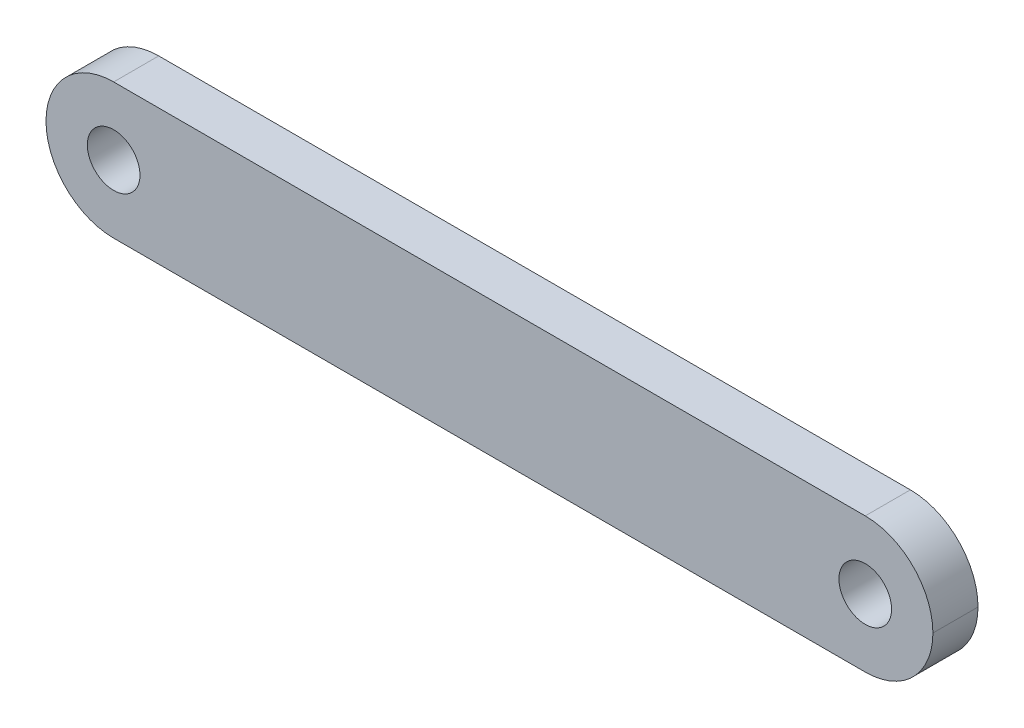
ISO-10303-21;
HEADER;
FILE_DESCRIPTION(('STEP AP214'),'2;1');
FILE_NAME('part.step','',(''),(''),'','','');
FILE_SCHEMA(('AUTOMOTIVE_DESIGN { 1 0 10303 214 1 1 1 1 }'));
ENDSEC;
DATA;
#1=APPLICATION_CONTEXT('core data for automotive mechanical design processes');
#2=APPLICATION_PROTOCOL_DEFINITION('international standard','automotive_design',2000,#1);
#3=PRODUCT_CONTEXT('',#1,'mechanical');
#4=PRODUCT('Part','Part','',(#3));
#5=PRODUCT_RELATED_PRODUCT_CATEGORY('part','',(#4));
#6=PRODUCT_DEFINITION_FORMATION('','',#4);
#7=PRODUCT_DEFINITION_CONTEXT('part definition',#1,'design');
#8=PRODUCT_DEFINITION('design','',#6,#7);
#9=PRODUCT_DEFINITION_SHAPE('','',#8);
#10=(LENGTH_UNIT() NAMED_UNIT(*) SI_UNIT(.MILLI.,.METRE.));
#11=(NAMED_UNIT(*) PLANE_ANGLE_UNIT() SI_UNIT($,.RADIAN.));
#12=(NAMED_UNIT(*) SI_UNIT($,.STERADIAN.) SOLID_ANGLE_UNIT());
#13=UNCERTAINTY_MEASURE_WITH_UNIT(LENGTH_MEASURE(1.E-05),#10,'distance_accuracy_value','');
#14=(GEOMETRIC_REPRESENTATION_CONTEXT(3) GLOBAL_UNCERTAINTY_ASSIGNED_CONTEXT((#13)) GLOBAL_UNIT_ASSIGNED_CONTEXT((#10,
#11,#12)) REPRESENTATION_CONTEXT('',''));
#15=CARTESIAN_POINT('',(0.,0.,0.));
#16=DIRECTION('',(0.,0.,1.));
#17=DIRECTION('',(1.,0.,0.));
#18=AXIS2_PLACEMENT_3D('',#15,#16,#17);
#19=CARTESIAN_POINT('',(0.,0.,6.));
#20=DIRECTION('',(0.,0.,-1.));
#21=DIRECTION('',(-1.,0.,0.));
#22=AXIS2_PLACEMENT_3D('',#19,#20,#21);
#23=PLANE('',#22);
#24=CARTESIAN_POINT('',(109.,9.,6.));
#25=DIRECTION('',(0.,0.,-1.));
#26=DIRECTION('',(-1.,0.,0.));
#27=AXIS2_PLACEMENT_3D('',#24,#25,#26);
#28=CIRCLE('',#27,9.);
#29=CARTESIAN_POINT('',(109.,0.,6.));
#30=VERTEX_POINT('',#29);
#31=CARTESIAN_POINT('',(118.,9.,6.));
#32=VERTEX_POINT('',#31);
#33=EDGE_CURVE('E49',#30,#32,#28,.F.);
#34=ORIENTED_EDGE('',*,*,#33,.T.);
#35=CARTESIAN_POINT('',(109.,9.,6.));
#36=DIRECTION('',(0.,0.,-1.));
#37=DIRECTION('',(-1.,0.,0.));
#38=AXIS2_PLACEMENT_3D('',#35,#36,#37);
#39=CIRCLE('',#38,9.);
#40=CARTESIAN_POINT('',(109.,18.,6.));
#41=VERTEX_POINT('',#40);
#42=EDGE_CURVE('E130',#32,#41,#39,.F.);
#43=ORIENTED_EDGE('',*,*,#42,.T.);
#44=DIRECTION('',(-1.,0.,0.));
#45=VECTOR('',#44,1.);
#46=CARTESIAN_POINT('',(0.,18.,6.));
#47=LINE('',#46,#45);
#48=CARTESIAN_POINT('',(9.,18.,6.));
#49=VERTEX_POINT('',#48);
#50=EDGE_CURVE('E106',#41,#49,#47,.T.);
#51=ORIENTED_EDGE('',*,*,#50,.T.);
#52=CARTESIAN_POINT('',(9.,9.,6.));
#53=DIRECTION('',(0.,0.,-1.));
#54=DIRECTION('',(-1.,0.,0.));
#55=AXIS2_PLACEMENT_3D('',#52,#53,#54);
#56=CIRCLE('',#55,9.);
#57=CARTESIAN_POINT('',(0.,9.,6.));
#58=VERTEX_POINT('',#57);
#59=EDGE_CURVE('E96',#49,#58,#56,.F.);
#60=ORIENTED_EDGE('',*,*,#59,.T.);
#61=CARTESIAN_POINT('',(9.,9.,6.));
#62=DIRECTION('',(0.,0.,-1.));
#63=DIRECTION('',(-1.,0.,0.));
#64=AXIS2_PLACEMENT_3D('',#61,#62,#63);
#65=CIRCLE('',#64,9.);
#66=CARTESIAN_POINT('',(9.,0.,6.));
#67=VERTEX_POINT('',#66);
#68=EDGE_CURVE('E127',#58,#67,#65,.F.);
#69=ORIENTED_EDGE('',*,*,#68,.T.);
#70=DIRECTION('',(1.,0.,0.));
#71=VECTOR('',#70,1.);
#72=CARTESIAN_POINT('',(0.,0.,6.));
#73=LINE('',#72,#71);
#74=EDGE_CURVE('E113',#67,#30,#73,.T.);
#75=ORIENTED_EDGE('',*,*,#74,.T.);
#76=EDGE_LOOP('',(#34,#43,#51,#60,#69,#75));
#77=FACE_BOUND('',#76,.T.);
#78=CARTESIAN_POINT('',(9.,9.,6.));
#79=DIRECTION('',(0.,0.,1.));
#80=DIRECTION('',(1.,0.,0.));
#81=AXIS2_PLACEMENT_3D('',#78,#79,#80);
#82=CIRCLE('',#81,3.5);
#83=CARTESIAN_POINT('',(12.5,9.,6.));
#84=VERTEX_POINT('',#83);
#85=EDGE_CURVE('E117',#84,#84,#82,.T.);
#86=ORIENTED_EDGE('',*,*,#85,.F.);
#87=EDGE_LOOP('',(#86));
#88=FACE_BOUND('',#87,.T.);
#89=CARTESIAN_POINT('',(109.,9.,6.));
#90=DIRECTION('',(0.,0.,1.));
#91=DIRECTION('',(-1.,0.,0.));
#92=AXIS2_PLACEMENT_3D('',#89,#90,#91);
#93=CIRCLE('',#92,3.50000000000001);
#94=CARTESIAN_POINT('',(105.5,9.,6.));
#95=VERTEX_POINT('',#94);
#96=EDGE_CURVE('E135',#95,#95,#93,.T.);
#97=ORIENTED_EDGE('',*,*,#96,.F.);
#98=EDGE_LOOP('',(#97));
#99=FACE_BOUND('',#98,.T.);
#100=ADVANCED_FACE('F32',(#77,#88,#99),#23,.F.);
#101=CARTESIAN_POINT('',(0.,0.,0.));
#102=DIRECTION('',(0.,0.,-1.));
#103=DIRECTION('',(-1.,0.,0.));
#104=AXIS2_PLACEMENT_3D('',#101,#102,#103);
#105=PLANE('',#104);
#106=CARTESIAN_POINT('',(9.,9.,0.));
#107=DIRECTION('',(0.,0.,1.));
#108=DIRECTION('',(1.,0.,0.));
#109=AXIS2_PLACEMENT_3D('',#106,#107,#108);
#110=CIRCLE('',#109,3.5);
#111=CARTESIAN_POINT('',(12.5,9.,0.));
#112=VERTEX_POINT('',#111);
#113=EDGE_CURVE('E147',#112,#112,#110,.T.);
#114=ORIENTED_EDGE('',*,*,#113,.T.);
#115=EDGE_LOOP('',(#114));
#116=FACE_BOUND('',#115,.T.);
#117=DIRECTION('',(-1.,0.,0.));
#118=VECTOR('',#117,1.);
#119=CARTESIAN_POINT('',(0.,18.,0.));
#120=LINE('',#119,#118);
#121=CARTESIAN_POINT('',(109.,18.,0.));
#122=VERTEX_POINT('',#121);
#123=CARTESIAN_POINT('',(9.,18.,0.));
#124=VERTEX_POINT('',#123);
#125=EDGE_CURVE('E103',#122,#124,#120,.T.);
#126=ORIENTED_EDGE('',*,*,#125,.F.);
#127=CARTESIAN_POINT('',(109.,9.,0.));
#128=DIRECTION('',(0.,0.,-1.));
#129=DIRECTION('',(-1.,0.,0.));
#130=AXIS2_PLACEMENT_3D('',#127,#128,#129);
#131=CIRCLE('',#130,9.);
#132=CARTESIAN_POINT('',(118.,9.,0.));
#133=VERTEX_POINT('',#132);
#134=EDGE_CURVE('E87',#122,#133,#131,.T.);
#135=ORIENTED_EDGE('',*,*,#134,.T.);
#136=CARTESIAN_POINT('',(109.,9.,0.));
#137=DIRECTION('',(0.,0.,-1.));
#138=DIRECTION('',(-1.,0.,0.));
#139=AXIS2_PLACEMENT_3D('',#136,#137,#138);
#140=CIRCLE('',#139,9.);
#141=CARTESIAN_POINT('',(109.,0.,0.));
#142=VERTEX_POINT('',#141);
#143=EDGE_CURVE('E97',#133,#142,#140,.T.);
#144=ORIENTED_EDGE('',*,*,#143,.T.);
#145=DIRECTION('',(1.,0.,0.));
#146=VECTOR('',#145,1.);
#147=CARTESIAN_POINT('',(0.,0.,0.));
#148=LINE('',#147,#146);
#149=CARTESIAN_POINT('',(9.,0.,0.));
#150=VERTEX_POINT('',#149);
#151=EDGE_CURVE('E114',#150,#142,#148,.T.);
#152=ORIENTED_EDGE('',*,*,#151,.F.);
#153=CARTESIAN_POINT('',(9.,9.,0.));
#154=DIRECTION('',(0.,0.,-1.));
#155=DIRECTION('',(-1.,0.,0.));
#156=AXIS2_PLACEMENT_3D('',#153,#154,#155);
#157=CIRCLE('',#156,9.);
#158=CARTESIAN_POINT('',(0.,9.,0.));
#159=VERTEX_POINT('',#158);
#160=EDGE_CURVE('E123',#150,#159,#157,.T.);
#161=ORIENTED_EDGE('',*,*,#160,.T.);
#162=CARTESIAN_POINT('',(9.,9.,0.));
#163=DIRECTION('',(0.,0.,-1.));
#164=DIRECTION('',(-1.,0.,0.));
#165=AXIS2_PLACEMENT_3D('',#162,#163,#164);
#166=CIRCLE('',#165,9.);
#167=EDGE_CURVE('E107',#159,#124,#166,.T.);
#168=ORIENTED_EDGE('',*,*,#167,.T.);
#169=EDGE_LOOP('',(#126,#135,#144,#152,#161,#168));
#170=FACE_BOUND('',#169,.T.);
#171=CARTESIAN_POINT('',(109.,9.,0.));
#172=DIRECTION('',(0.,0.,1.));
#173=DIRECTION('',(-1.,0.,0.));
#174=AXIS2_PLACEMENT_3D('',#171,#172,#173);
#175=CIRCLE('',#174,3.50000000000001);
#176=CARTESIAN_POINT('',(105.5,9.,0.));
#177=VERTEX_POINT('',#176);
#178=EDGE_CURVE('E133',#177,#177,#175,.T.);
#179=ORIENTED_EDGE('',*,*,#178,.T.);
#180=EDGE_LOOP('',(#179));
#181=FACE_BOUND('',#180,.T.);
#182=ADVANCED_FACE('F110',(#116,#170,#181),#105,.T.);
#183=CARTESIAN_POINT('',(0.,0.,6.));
#184=DIRECTION('',(0.,1.,0.));
#185=DIRECTION('',(0.,0.,1.));
#186=AXIS2_PLACEMENT_3D('',#183,#184,#185);
#187=PLANE('',#186);
#188=ORIENTED_EDGE('',*,*,#151,.T.);
#189=DIRECTION('',(0.,0.,-1.));
#190=VECTOR('',#189,1.);
#191=CARTESIAN_POINT('',(109.,0.,6.));
#192=LINE('',#191,#190);
#193=EDGE_CURVE('E11',#142,#30,#192,.F.);
#194=ORIENTED_EDGE('',*,*,#193,.T.);
#195=ORIENTED_EDGE('',*,*,#74,.F.);
#196=DIRECTION('',(0.,0.,-1.));
#197=VECTOR('',#196,1.);
#198=CARTESIAN_POINT('',(9.,0.,6.));
#199=LINE('',#198,#197);
#200=EDGE_CURVE('E41',#67,#150,#199,.T.);
#201=ORIENTED_EDGE('',*,*,#200,.T.);
#202=EDGE_LOOP('',(#188,#194,#195,#201));
#203=FACE_BOUND('',#202,.T.);
#204=ADVANCED_FACE('F163',(#203),#187,.F.);
#205=CARTESIAN_POINT('',(0.,18.,6.));
#206=DIRECTION('',(0.,-1.,0.));
#207=DIRECTION('',(0.,0.,-1.));
#208=AXIS2_PLACEMENT_3D('',#205,#206,#207);
#209=PLANE('',#208);
#210=ORIENTED_EDGE('',*,*,#50,.F.);
#211=DIRECTION('',(0.,0.,-1.));
#212=VECTOR('',#211,1.);
#213=CARTESIAN_POINT('',(109.,18.,6.));
#214=LINE('',#213,#212);
#215=EDGE_CURVE('E91',#41,#122,#214,.T.);
#216=ORIENTED_EDGE('',*,*,#215,.T.);
#217=ORIENTED_EDGE('',*,*,#125,.T.);
#218=DIRECTION('',(0.,0.,-1.));
#219=VECTOR('',#218,1.);
#220=CARTESIAN_POINT('',(9.,18.,6.));
#221=LINE('',#220,#219);
#222=EDGE_CURVE('E108',#124,#49,#221,.F.);
#223=ORIENTED_EDGE('',*,*,#222,.T.);
#224=EDGE_LOOP('',(#210,#216,#217,#223));
#225=FACE_BOUND('',#224,.T.);
#226=ADVANCED_FACE('F102',(#225),#209,.F.);
#227=CARTESIAN_POINT('',(9.,9.,6.));
#228=DIRECTION('',(0.,0.,-1.));
#229=DIRECTION('',(-1.,0.,0.));
#230=AXIS2_PLACEMENT_3D('',#227,#228,#229);
#231=CYLINDRICAL_SURFACE('',#230,3.5);
#232=ORIENTED_EDGE('',*,*,#85,.T.);
#233=EDGE_LOOP('',(#232));
#234=FACE_BOUND('',#233,.T.);
#235=ORIENTED_EDGE('',*,*,#113,.F.);
#236=EDGE_LOOP('',(#235));
#237=FACE_BOUND('',#236,.T.);
#238=ADVANCED_FACE('F167',(#234,#237),#231,.F.);
#239=CARTESIAN_POINT('',(109.,9.,6.));
#240=DIRECTION('',(0.,0.,-1.));
#241=DIRECTION('',(-1.,0.,0.));
#242=AXIS2_PLACEMENT_3D('',#239,#240,#241);
#243=CYLINDRICAL_SURFACE('',#242,3.50000000000001);
#244=ORIENTED_EDGE('',*,*,#96,.T.);
#245=EDGE_LOOP('',(#244));
#246=FACE_BOUND('',#245,.T.);
#247=ORIENTED_EDGE('',*,*,#178,.F.);
#248=EDGE_LOOP('',(#247));
#249=FACE_BOUND('',#248,.T.);
#250=ADVANCED_FACE('F155',(#246,#249),#243,.F.);
#251=CARTESIAN_POINT('',(109.,9.,6.));
#252=DIRECTION('',(0.,0.,-1.));
#253=DIRECTION('',(-1.,0.,0.));
#254=AXIS2_PLACEMENT_3D('',#251,#252,#253);
#255=CYLINDRICAL_SURFACE('',#254,9.);
#256=DIRECTION('',(0.,0.,-1.));
#257=VECTOR('',#256,1.);
#258=CARTESIAN_POINT('',(118.,9.,6.));
#259=LINE('',#258,#257);
#260=EDGE_CURVE('E92',#32,#133,#259,.T.);
#261=ORIENTED_EDGE('',*,*,#260,.F.);
#262=ORIENTED_EDGE('',*,*,#33,.F.);
#263=ORIENTED_EDGE('',*,*,#193,.F.);
#264=ORIENTED_EDGE('',*,*,#143,.F.);
#265=EDGE_LOOP('',(#261,#262,#263,#264));
#266=FACE_BOUND('',#265,.T.);
#267=ADVANCED_FACE('F176',(#266),#255,.T.);
#268=CARTESIAN_POINT('',(109.,9.,6.));
#269=DIRECTION('',(0.,0.,-1.));
#270=DIRECTION('',(-1.,0.,0.));
#271=AXIS2_PLACEMENT_3D('',#268,#269,#270);
#272=CYLINDRICAL_SURFACE('',#271,9.);
#273=ORIENTED_EDGE('',*,*,#42,.F.);
#274=ORIENTED_EDGE('',*,*,#260,.T.);
#275=ORIENTED_EDGE('',*,*,#134,.F.);
#276=ORIENTED_EDGE('',*,*,#215,.F.);
#277=EDGE_LOOP('',(#273,#274,#275,#276));
#278=FACE_BOUND('',#277,.T.);
#279=ADVANCED_FACE('F90',(#278),#272,.T.);
#280=CARTESIAN_POINT('',(9.,9.,6.));
#281=DIRECTION('',(0.,0.,-1.));
#282=DIRECTION('',(-1.,0.,0.));
#283=AXIS2_PLACEMENT_3D('',#280,#281,#282);
#284=CYLINDRICAL_SURFACE('',#283,9.);
#285=DIRECTION('',(0.,0.,-1.));
#286=VECTOR('',#285,1.);
#287=CARTESIAN_POINT('',(0.,9.,6.));
#288=LINE('',#287,#286);
#289=EDGE_CURVE('E36',#58,#159,#288,.T.);
#290=ORIENTED_EDGE('',*,*,#289,.F.);
#291=ORIENTED_EDGE('',*,*,#59,.F.);
#292=ORIENTED_EDGE('',*,*,#222,.F.);
#293=ORIENTED_EDGE('',*,*,#167,.F.);
#294=EDGE_LOOP('',(#290,#291,#292,#293));
#295=FACE_BOUND('',#294,.T.);
#296=ADVANCED_FACE('F34',(#295),#284,.T.);
#297=CARTESIAN_POINT('',(9.,9.,6.));
#298=DIRECTION('',(0.,0.,-1.));
#299=DIRECTION('',(-1.,0.,0.));
#300=AXIS2_PLACEMENT_3D('',#297,#298,#299);
#301=CYLINDRICAL_SURFACE('',#300,9.);
#302=ORIENTED_EDGE('',*,*,#68,.F.);
#303=ORIENTED_EDGE('',*,*,#289,.T.);
#304=ORIENTED_EDGE('',*,*,#160,.F.);
#305=ORIENTED_EDGE('',*,*,#200,.F.);
#306=EDGE_LOOP('',(#302,#303,#304,#305));
#307=FACE_BOUND('',#306,.T.);
#308=ADVANCED_FACE('F141',(#307),#301,.T.);
#309=CLOSED_SHELL('',(#100,#182,#204,#226,#238,#250,#267,#279,#296,#308));
#310=MANIFOLD_SOLID_BREP('B2',#309);
#311=ADVANCED_BREP_SHAPE_REPRESENTATION('',(#18,#310),#14);
#312=SHAPE_DEFINITION_REPRESENTATION(#9,#311);
ENDSEC;
END-ISO-10303-21;
